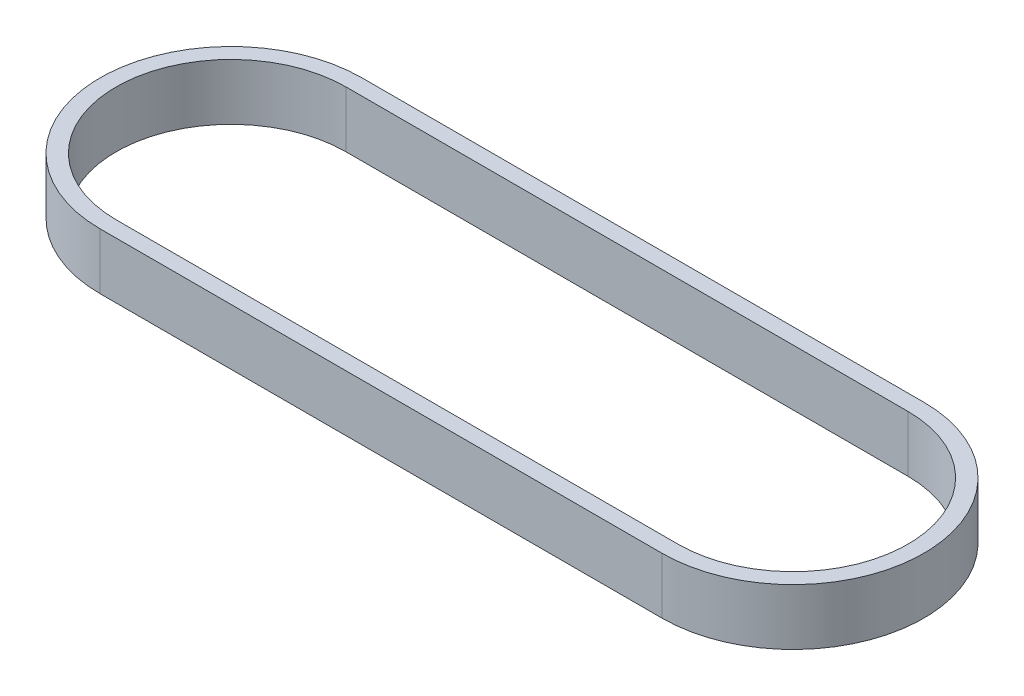
ISO-10303-21;
HEADER;
FILE_DESCRIPTION(('STEP AP214'),'2;1');
FILE_NAME('part.step','',(''),(''),'','','');
FILE_SCHEMA(('AUTOMOTIVE_DESIGN { 1 0 10303 214 1 1 1 1 }'));
ENDSEC;
DATA;
#1=APPLICATION_CONTEXT('core data for automotive mechanical design processes');
#2=APPLICATION_PROTOCOL_DEFINITION('international standard','automotive_design',2000,#1);
#3=PRODUCT_CONTEXT('',#1,'mechanical');
#4=PRODUCT('Part','Part','',(#3));
#5=PRODUCT_RELATED_PRODUCT_CATEGORY('part','',(#4));
#6=PRODUCT_DEFINITION_FORMATION('','',#4);
#7=PRODUCT_DEFINITION_CONTEXT('part definition',#1,'design');
#8=PRODUCT_DEFINITION('design','',#6,#7);
#9=PRODUCT_DEFINITION_SHAPE('','',#8);
#10=(LENGTH_UNIT() NAMED_UNIT(*) SI_UNIT(.MILLI.,.METRE.));
#11=(NAMED_UNIT(*) PLANE_ANGLE_UNIT() SI_UNIT($,.RADIAN.));
#12=(NAMED_UNIT(*) SI_UNIT($,.STERADIAN.) SOLID_ANGLE_UNIT());
#13=UNCERTAINTY_MEASURE_WITH_UNIT(LENGTH_MEASURE(1.E-05),#10,'distance_accuracy_value','');
#14=(GEOMETRIC_REPRESENTATION_CONTEXT(3) GLOBAL_UNCERTAINTY_ASSIGNED_CONTEXT((#13)) GLOBAL_UNIT_ASSIGNED_CONTEXT((#10,
#11,#12)) REPRESENTATION_CONTEXT('',''));
#15=CARTESIAN_POINT('',(0.,0.,0.));
#16=DIRECTION('',(0.,0.,1.));
#17=DIRECTION('',(1.,0.,0.));
#18=AXIS2_PLACEMENT_3D('',#15,#16,#17);
#19=CARTESIAN_POINT('',(44.99991,9.,0.));
#20=DIRECTION('',(0.,1.,0.));
#21=DIRECTION('',(0.,0.,1.));
#22=AXIS2_PLACEMENT_3D('',#19,#20,#21);
#23=PLANE('',#22);
#24=CARTESIAN_POINT('',(44.99991,9.,0.));
#25=DIRECTION('',(0.,1.,0.));
#26=DIRECTION('',(0.,0.,1.));
#27=AXIS2_PLACEMENT_3D('',#24,#25,#26);
#28=CIRCLE('',#27,20.955);
#29=CARTESIAN_POINT('',(44.99991,9.,20.955));
#30=VERTEX_POINT('',#29);
#31=CARTESIAN_POINT('',(44.99991,9.,-20.955));
#32=VERTEX_POINT('',#31);
#33=EDGE_CURVE('E133',#30,#32,#28,.T.);
#34=ORIENTED_EDGE('',*,*,#33,.T.);
#35=DIRECTION('',(-1.,0.,0.));
#36=VECTOR('',#35,1.);
#37=CARTESIAN_POINT('',(44.99991,9.,-20.955));
#38=LINE('',#37,#36);
#39=CARTESIAN_POINT('',(-44.99991,9.,-20.955));
#40=VERTEX_POINT('',#39);
#41=EDGE_CURVE('E136',#32,#40,#38,.T.);
#42=ORIENTED_EDGE('',*,*,#41,.T.);
#43=CARTESIAN_POINT('',(-44.99991,9.,0.));
#44=DIRECTION('',(0.,1.,0.));
#45=DIRECTION('',(0.,0.,1.));
#46=AXIS2_PLACEMENT_3D('',#43,#44,#45);
#47=CIRCLE('',#46,20.955);
#48=CARTESIAN_POINT('',(-44.99991,9.,20.955));
#49=VERTEX_POINT('',#48);
#50=EDGE_CURVE('E139',#40,#49,#47,.T.);
#51=ORIENTED_EDGE('',*,*,#50,.T.);
#52=DIRECTION('',(1.,0.,0.));
#53=VECTOR('',#52,1.);
#54=CARTESIAN_POINT('',(44.99991,9.,20.955));
#55=LINE('',#54,#53);
#56=EDGE_CURVE('E141',#49,#30,#55,.T.);
#57=ORIENTED_EDGE('',*,*,#56,.T.);
#58=EDGE_LOOP('',(#34,#42,#51,#57));
#59=FACE_BOUND('',#58,.T.);
#60=DIRECTION('',(-1.,0.,0.));
#61=VECTOR('',#60,1.);
#62=CARTESIAN_POINT('',(44.99991,9.,-18.415));
#63=LINE('',#62,#61);
#64=CARTESIAN_POINT('',(44.99991,9.,-18.415));
#65=VERTEX_POINT('',#64);
#66=CARTESIAN_POINT('',(-44.99991,9.,-18.415));
#67=VERTEX_POINT('',#66);
#68=EDGE_CURVE('E105',#65,#67,#63,.T.);
#69=ORIENTED_EDGE('',*,*,#68,.F.);
#70=CARTESIAN_POINT('',(44.99991,9.,0.));
#71=DIRECTION('',(0.,1.,0.));
#72=DIRECTION('',(0.,0.,1.));
#73=AXIS2_PLACEMENT_3D('',#70,#71,#72);
#74=CIRCLE('',#73,18.415);
#75=CARTESIAN_POINT('',(44.99991,9.,18.415));
#76=VERTEX_POINT('',#75);
#77=EDGE_CURVE('E97',#76,#65,#74,.T.);
#78=ORIENTED_EDGE('',*,*,#77,.F.);
#79=DIRECTION('',(1.,0.,0.));
#80=VECTOR('',#79,1.);
#81=CARTESIAN_POINT('',(44.99991,9.,18.415));
#82=LINE('',#81,#80);
#83=CARTESIAN_POINT('',(-44.99991,9.,18.415));
#84=VERTEX_POINT('',#83);
#85=EDGE_CURVE('E119',#84,#76,#82,.T.);
#86=ORIENTED_EDGE('',*,*,#85,.F.);
#87=CARTESIAN_POINT('',(-44.99991,9.,0.));
#88=DIRECTION('',(0.,1.,0.));
#89=DIRECTION('',(0.,0.,1.));
#90=AXIS2_PLACEMENT_3D('',#87,#88,#89);
#91=CIRCLE('',#90,18.415);
#92=EDGE_CURVE('E117',#67,#84,#91,.T.);
#93=ORIENTED_EDGE('',*,*,#92,.F.);
#94=EDGE_LOOP('',(#69,#78,#86,#93));
#95=FACE_BOUND('',#94,.T.);
#96=ADVANCED_FACE('F32',(#59,#95),#23,.T.);
#97=CARTESIAN_POINT('',(44.99991,0.,0.));
#98=DIRECTION('',(0.,1.,0.));
#99=DIRECTION('',(0.,0.,1.));
#100=AXIS2_PLACEMENT_3D('',#97,#98,#99);
#101=PLANE('',#100);
#102=CARTESIAN_POINT('',(44.99991,0.,0.));
#103=DIRECTION('',(0.,1.,0.));
#104=DIRECTION('',(0.,0.,1.));
#105=AXIS2_PLACEMENT_3D('',#102,#103,#104);
#106=CIRCLE('',#105,20.955);
#107=CARTESIAN_POINT('',(44.99991,0.,20.955));
#108=VERTEX_POINT('',#107);
#109=CARTESIAN_POINT('',(44.99991,0.,-20.955));
#110=VERTEX_POINT('',#109);
#111=EDGE_CURVE('E113',#108,#110,#106,.T.);
#112=ORIENTED_EDGE('',*,*,#111,.F.);
#113=DIRECTION('',(1.,0.,0.));
#114=VECTOR('',#113,1.);
#115=CARTESIAN_POINT('',(44.99991,0.,20.955));
#116=LINE('',#115,#114);
#117=CARTESIAN_POINT('',(-44.99991,0.,20.955));
#118=VERTEX_POINT('',#117);
#119=EDGE_CURVE('E137',#118,#108,#116,.T.);
#120=ORIENTED_EDGE('',*,*,#119,.F.);
#121=CARTESIAN_POINT('',(-44.99991,0.,0.));
#122=DIRECTION('',(0.,1.,0.));
#123=DIRECTION('',(0.,0.,1.));
#124=AXIS2_PLACEMENT_3D('',#121,#122,#123);
#125=CIRCLE('',#124,20.955);
#126=CARTESIAN_POINT('',(-44.99991,0.,-20.955));
#127=VERTEX_POINT('',#126);
#128=EDGE_CURVE('E148',#127,#118,#125,.T.);
#129=ORIENTED_EDGE('',*,*,#128,.F.);
#130=DIRECTION('',(-1.,0.,0.));
#131=VECTOR('',#130,1.);
#132=CARTESIAN_POINT('',(44.99991,0.,-20.955));
#133=LINE('',#132,#131);
#134=EDGE_CURVE('E146',#110,#127,#133,.T.);
#135=ORIENTED_EDGE('',*,*,#134,.F.);
#136=EDGE_LOOP('',(#112,#120,#129,#135));
#137=FACE_BOUND('',#136,.T.);
#138=CARTESIAN_POINT('',(44.99991,0.,0.));
#139=DIRECTION('',(0.,1.,0.));
#140=DIRECTION('',(0.,0.,1.));
#141=AXIS2_PLACEMENT_3D('',#138,#139,#140);
#142=CIRCLE('',#141,18.415);
#143=CARTESIAN_POINT('',(44.99991,0.,18.415));
#144=VERTEX_POINT('',#143);
#145=CARTESIAN_POINT('',(44.99991,0.,-18.415));
#146=VERTEX_POINT('',#145);
#147=EDGE_CURVE('E55',#144,#146,#142,.T.);
#148=ORIENTED_EDGE('',*,*,#147,.T.);
#149=DIRECTION('',(-1.,0.,0.));
#150=VECTOR('',#149,1.);
#151=CARTESIAN_POINT('',(44.99991,0.,-18.415));
#152=LINE('',#151,#150);
#153=CARTESIAN_POINT('',(-44.99991,0.,-18.415));
#154=VERTEX_POINT('',#153);
#155=EDGE_CURVE('E112',#146,#154,#152,.T.);
#156=ORIENTED_EDGE('',*,*,#155,.T.);
#157=CARTESIAN_POINT('',(-44.99991,0.,0.));
#158=DIRECTION('',(0.,1.,0.));
#159=DIRECTION('',(0.,0.,1.));
#160=AXIS2_PLACEMENT_3D('',#157,#158,#159);
#161=CIRCLE('',#160,18.415);
#162=CARTESIAN_POINT('',(-44.99991,0.,18.415));
#163=VERTEX_POINT('',#162);
#164=EDGE_CURVE('E125',#154,#163,#161,.T.);
#165=ORIENTED_EDGE('',*,*,#164,.T.);
#166=DIRECTION('',(1.,0.,0.));
#167=VECTOR('',#166,1.);
#168=CARTESIAN_POINT('',(44.99991,0.,18.415));
#169=LINE('',#168,#167);
#170=EDGE_CURVE('E106',#163,#144,#169,.T.);
#171=ORIENTED_EDGE('',*,*,#170,.T.);
#172=EDGE_LOOP('',(#148,#156,#165,#171));
#173=FACE_BOUND('',#172,.T.);
#174=ADVANCED_FACE('F166',(#137,#173),#101,.F.);
#175=CARTESIAN_POINT('',(44.99991,9.,0.));
#176=DIRECTION('',(0.,-1.,0.));
#177=DIRECTION('',(0.,0.,-1.));
#178=AXIS2_PLACEMENT_3D('',#175,#176,#177);
#179=CYLINDRICAL_SURFACE('',#178,20.955);
#180=ORIENTED_EDGE('',*,*,#111,.T.);
#181=DIRECTION('',(0.,-1.,0.));
#182=VECTOR('',#181,1.);
#183=CARTESIAN_POINT('',(44.99991,9.,-20.955));
#184=LINE('',#183,#182);
#185=EDGE_CURVE('E11',#32,#110,#184,.T.);
#186=ORIENTED_EDGE('',*,*,#185,.F.);
#187=ORIENTED_EDGE('',*,*,#33,.F.);
#188=DIRECTION('',(0.,-1.,0.));
#189=VECTOR('',#188,1.);
#190=CARTESIAN_POINT('',(44.99991,9.,20.955));
#191=LINE('',#190,#189);
#192=EDGE_CURVE('E143',#30,#108,#191,.T.);
#193=ORIENTED_EDGE('',*,*,#192,.T.);
#194=EDGE_LOOP('',(#180,#186,#187,#193));
#195=FACE_BOUND('',#194,.T.);
#196=ADVANCED_FACE('F34',(#195),#179,.T.);
#197=CARTESIAN_POINT('',(44.99991,9.,-20.955));
#198=DIRECTION('',(0.,0.,1.));
#199=DIRECTION('',(1.,0.,0.));
#200=AXIS2_PLACEMENT_3D('',#197,#198,#199);
#201=PLANE('',#200);
#202=ORIENTED_EDGE('',*,*,#134,.T.);
#203=DIRECTION('',(0.,-1.,0.));
#204=VECTOR('',#203,1.);
#205=CARTESIAN_POINT('',(-44.99991,9.,-20.955));
#206=LINE('',#205,#204);
#207=EDGE_CURVE('E40',#40,#127,#206,.T.);
#208=ORIENTED_EDGE('',*,*,#207,.F.);
#209=ORIENTED_EDGE('',*,*,#41,.F.);
#210=ORIENTED_EDGE('',*,*,#185,.T.);
#211=EDGE_LOOP('',(#202,#208,#209,#210));
#212=FACE_BOUND('',#211,.T.);
#213=ADVANCED_FACE('F176',(#212),#201,.F.);
#214=CARTESIAN_POINT('',(-44.99991,9.,0.));
#215=DIRECTION('',(0.,-1.,0.));
#216=DIRECTION('',(0.,0.,-1.));
#217=AXIS2_PLACEMENT_3D('',#214,#215,#216);
#218=CYLINDRICAL_SURFACE('',#217,20.955);
#219=ORIENTED_EDGE('',*,*,#128,.T.);
#220=DIRECTION('',(0.,-1.,0.));
#221=VECTOR('',#220,1.);
#222=CARTESIAN_POINT('',(-44.99991,9.,20.955));
#223=LINE('',#222,#221);
#224=EDGE_CURVE('E153',#49,#118,#223,.T.);
#225=ORIENTED_EDGE('',*,*,#224,.F.);
#226=ORIENTED_EDGE('',*,*,#50,.F.);
#227=ORIENTED_EDGE('',*,*,#207,.T.);
#228=EDGE_LOOP('',(#219,#225,#226,#227));
#229=FACE_BOUND('',#228,.T.);
#230=ADVANCED_FACE('F160',(#229),#218,.T.);
#231=CARTESIAN_POINT('',(44.99991,9.,20.955));
#232=DIRECTION('',(0.,0.,-1.));
#233=DIRECTION('',(-1.,0.,0.));
#234=AXIS2_PLACEMENT_3D('',#231,#232,#233);
#235=PLANE('',#234);
#236=ORIENTED_EDGE('',*,*,#119,.T.);
#237=ORIENTED_EDGE('',*,*,#192,.F.);
#238=ORIENTED_EDGE('',*,*,#56,.F.);
#239=ORIENTED_EDGE('',*,*,#224,.T.);
#240=EDGE_LOOP('',(#236,#237,#238,#239));
#241=FACE_BOUND('',#240,.T.);
#242=ADVANCED_FACE('F170',(#241),#235,.F.);
#243=CARTESIAN_POINT('',(44.99991,9.,0.));
#244=DIRECTION('',(0.,-1.,0.));
#245=DIRECTION('',(0.,0.,-1.));
#246=AXIS2_PLACEMENT_3D('',#243,#244,#245);
#247=CYLINDRICAL_SURFACE('',#246,18.415);
#248=ORIENTED_EDGE('',*,*,#147,.F.);
#249=DIRECTION('',(0.,-1.,0.));
#250=VECTOR('',#249,1.);
#251=CARTESIAN_POINT('',(44.99991,9.,18.415));
#252=LINE('',#251,#250);
#253=EDGE_CURVE('E101',#76,#144,#252,.T.);
#254=ORIENTED_EDGE('',*,*,#253,.F.);
#255=ORIENTED_EDGE('',*,*,#77,.T.);
#256=DIRECTION('',(0.,-1.,0.));
#257=VECTOR('',#256,1.);
#258=CARTESIAN_POINT('',(44.99991,9.,-18.415));
#259=LINE('',#258,#257);
#260=EDGE_CURVE('E100',#65,#146,#259,.T.);
#261=ORIENTED_EDGE('',*,*,#260,.T.);
#262=EDGE_LOOP('',(#248,#254,#255,#261));
#263=FACE_BOUND('',#262,.T.);
#264=ADVANCED_FACE('F99',(#263),#247,.F.);
#265=CARTESIAN_POINT('',(44.99991,9.,-18.415));
#266=DIRECTION('',(0.,0.,1.));
#267=DIRECTION('',(1.,0.,0.));
#268=AXIS2_PLACEMENT_3D('',#265,#266,#267);
#269=PLANE('',#268);
#270=ORIENTED_EDGE('',*,*,#155,.F.);
#271=ORIENTED_EDGE('',*,*,#260,.F.);
#272=ORIENTED_EDGE('',*,*,#68,.T.);
#273=DIRECTION('',(0.,-1.,0.));
#274=VECTOR('',#273,1.);
#275=CARTESIAN_POINT('',(-44.99991,9.,-18.415));
#276=LINE('',#275,#274);
#277=EDGE_CURVE('E114',#67,#154,#276,.T.);
#278=ORIENTED_EDGE('',*,*,#277,.T.);
#279=EDGE_LOOP('',(#270,#271,#272,#278));
#280=FACE_BOUND('',#279,.T.);
#281=ADVANCED_FACE('F109',(#280),#269,.T.);
#282=CARTESIAN_POINT('',(-44.99991,9.,0.));
#283=DIRECTION('',(0.,-1.,0.));
#284=DIRECTION('',(0.,0.,-1.));
#285=AXIS2_PLACEMENT_3D('',#282,#283,#284);
#286=CYLINDRICAL_SURFACE('',#285,18.415);
#287=ORIENTED_EDGE('',*,*,#164,.F.);
#288=ORIENTED_EDGE('',*,*,#277,.F.);
#289=ORIENTED_EDGE('',*,*,#92,.T.);
#290=DIRECTION('',(0.,-1.,0.));
#291=VECTOR('',#290,1.);
#292=CARTESIAN_POINT('',(-44.99991,9.,18.415));
#293=LINE('',#292,#291);
#294=EDGE_CURVE('E47',#84,#163,#293,.T.);
#295=ORIENTED_EDGE('',*,*,#294,.T.);
#296=EDGE_LOOP('',(#287,#288,#289,#295));
#297=FACE_BOUND('',#296,.T.);
#298=ADVANCED_FACE('F199',(#297),#286,.F.);
#299=CARTESIAN_POINT('',(44.99991,9.,18.415));
#300=DIRECTION('',(0.,0.,-1.));
#301=DIRECTION('',(-1.,0.,0.));
#302=AXIS2_PLACEMENT_3D('',#299,#300,#301);
#303=PLANE('',#302);
#304=ORIENTED_EDGE('',*,*,#170,.F.);
#305=ORIENTED_EDGE('',*,*,#294,.F.);
#306=ORIENTED_EDGE('',*,*,#85,.T.);
#307=ORIENTED_EDGE('',*,*,#253,.T.);
#308=EDGE_LOOP('',(#304,#305,#306,#307));
#309=FACE_BOUND('',#308,.T.);
#310=ADVANCED_FACE('F203',(#309),#303,.T.);
#311=CLOSED_SHELL('',(#96,#174,#196,#213,#230,#242,#264,#281,#298,#310));
#312=MANIFOLD_SOLID_BREP('B2',#311);
#313=ADVANCED_BREP_SHAPE_REPRESENTATION('',(#18,#312),#14);
#314=SHAPE_DEFINITION_REPRESENTATION(#9,#313);
ENDSEC;
END-ISO-10303-21;
